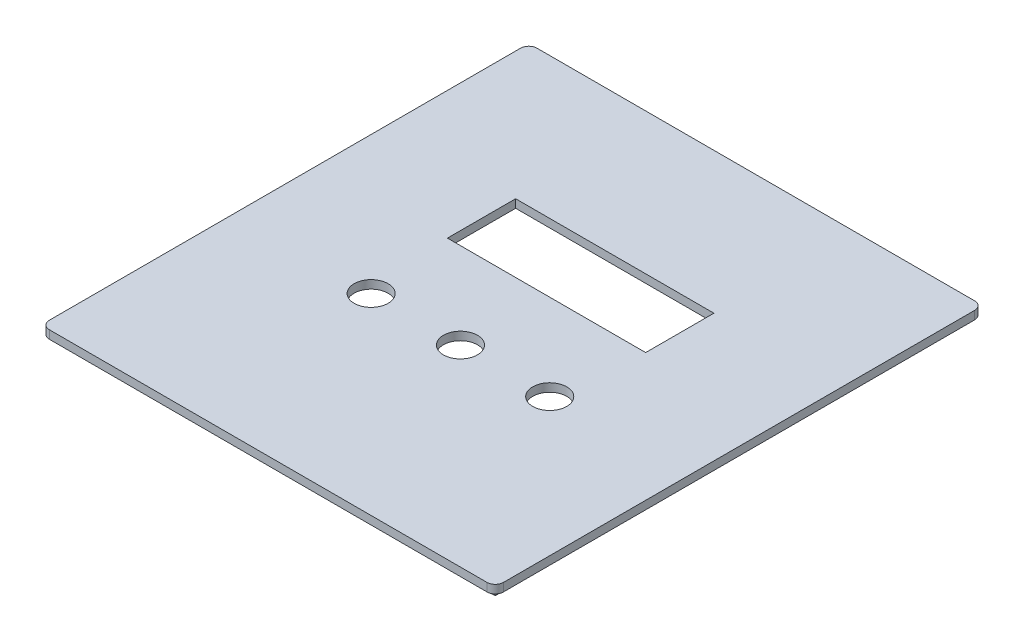
ISO-10303-21;
HEADER;
FILE_DESCRIPTION(('STEP AP214'),'2;1');
FILE_NAME('part.step','',(''),(''),'','','');
FILE_SCHEMA(('AUTOMOTIVE_DESIGN { 1 0 10303 214 1 1 1 1 }'));
ENDSEC;
DATA;
#1=APPLICATION_CONTEXT('core data for automotive mechanical design processes');
#2=APPLICATION_PROTOCOL_DEFINITION('international standard','automotive_design',2000,#1);
#3=PRODUCT_CONTEXT('',#1,'mechanical');
#4=PRODUCT('Part','Part','',(#3));
#5=PRODUCT_RELATED_PRODUCT_CATEGORY('part','',(#4));
#6=PRODUCT_DEFINITION_FORMATION('','',#4);
#7=PRODUCT_DEFINITION_CONTEXT('part definition',#1,'design');
#8=PRODUCT_DEFINITION('design','',#6,#7);
#9=PRODUCT_DEFINITION_SHAPE('','',#8);
#10=(LENGTH_UNIT() NAMED_UNIT(*) SI_UNIT(.MILLI.,.METRE.));
#11=(NAMED_UNIT(*) PLANE_ANGLE_UNIT() SI_UNIT($,.RADIAN.));
#12=(NAMED_UNIT(*) SI_UNIT($,.STERADIAN.) SOLID_ANGLE_UNIT());
#13=UNCERTAINTY_MEASURE_WITH_UNIT(LENGTH_MEASURE(1.E-05),#10,'distance_accuracy_value','');
#14=(GEOMETRIC_REPRESENTATION_CONTEXT(3) GLOBAL_UNCERTAINTY_ASSIGNED_CONTEXT((#13)) GLOBAL_UNIT_ASSIGNED_CONTEXT((#10,
#11,#12)) REPRESENTATION_CONTEXT('',''));
#15=CARTESIAN_POINT('',(0.,0.,0.));
#16=DIRECTION('',(0.,0.,1.));
#17=DIRECTION('',(1.,0.,0.));
#18=AXIS2_PLACEMENT_3D('',#15,#16,#17);
#19=CARTESIAN_POINT('',(0.,0.,0.));
#20=DIRECTION('',(0.,-1.,0.));
#21=DIRECTION('',(0.,0.,-1.));
#22=AXIS2_PLACEMENT_3D('',#19,#20,#21);
#23=PLANE('',#22);
#24=DIRECTION('',(-1.,0.,0.));
#25=VECTOR('',#24,1.);
#26=CARTESIAN_POINT('',(-78.85,0.,-84.92));
#27=LINE('',#26,#25);
#28=CARTESIAN_POINT('',(78.85,0.,-84.92));
#29=VERTEX_POINT('',#28);
#30=CARTESIAN_POINT('',(-78.85,0.,-84.92));
#31=VERTEX_POINT('',#30);
#32=EDGE_CURVE('E280',#29,#31,#27,.T.);
#33=ORIENTED_EDGE('',*,*,#32,.F.);
#34=DIRECTION('',(0.,0.,-1.));
#35=VECTOR('',#34,1.);
#36=CARTESIAN_POINT('',(78.85,0.,-84.92));
#37=LINE('',#36,#35);
#38=CARTESIAN_POINT('',(78.85,0.,84.92));
#39=VERTEX_POINT('',#38);
#40=EDGE_CURVE('E285',#39,#29,#37,.T.);
#41=ORIENTED_EDGE('',*,*,#40,.F.);
#42=DIRECTION('',(1.,0.,0.));
#43=VECTOR('',#42,1.);
#44=CARTESIAN_POINT('',(-78.85,0.,84.92));
#45=LINE('',#44,#43);
#46=CARTESIAN_POINT('',(-78.85,0.,84.92));
#47=VERTEX_POINT('',#46);
#48=EDGE_CURVE('E299',#47,#39,#45,.T.);
#49=ORIENTED_EDGE('',*,*,#48,.F.);
#50=DIRECTION('',(0.,0.,1.));
#51=VECTOR('',#50,1.);
#52=CARTESIAN_POINT('',(-78.85,0.,-84.92));
#53=LINE('',#52,#51);
#54=EDGE_CURVE('E297',#31,#47,#53,.T.);
#55=ORIENTED_EDGE('',*,*,#54,.F.);
#56=EDGE_LOOP('',(#33,#41,#49,#55));
#57=FACE_BOUND('',#56,.T.);
#58=DIRECTION('',(0.,0.,-1.));
#59=VECTOR('',#58,1.);
#60=CARTESIAN_POINT('',(75.85,0.,-81.92));
#61=LINE('',#60,#59);
#62=CARTESIAN_POINT('',(75.85,0.,81.92));
#63=VERTEX_POINT('',#62);
#64=CARTESIAN_POINT('',(75.85,0.,-81.92));
#65=VERTEX_POINT('',#64);
#66=EDGE_CURVE('E251',#63,#65,#61,.T.);
#67=ORIENTED_EDGE('',*,*,#66,.T.);
#68=DIRECTION('',(-1.,0.,0.));
#69=VECTOR('',#68,1.);
#70=CARTESIAN_POINT('',(-75.85,0.,-81.92));
#71=LINE('',#70,#69);
#72=CARTESIAN_POINT('',(-75.85,0.,-81.92));
#73=VERTEX_POINT('',#72);
#74=EDGE_CURVE('E237',#65,#73,#71,.T.);
#75=ORIENTED_EDGE('',*,*,#74,.T.);
#76=DIRECTION('',(0.,0.,1.));
#77=VECTOR('',#76,1.);
#78=CARTESIAN_POINT('',(-75.85,0.,-81.92));
#79=LINE('',#78,#77);
#80=CARTESIAN_POINT('',(-75.85,0.,81.92));
#81=VERTEX_POINT('',#80);
#82=EDGE_CURVE('E263',#73,#81,#79,.T.);
#83=ORIENTED_EDGE('',*,*,#82,.T.);
#84=DIRECTION('',(1.,0.,0.));
#85=VECTOR('',#84,1.);
#86=CARTESIAN_POINT('',(-75.85,0.,81.92));
#87=LINE('',#86,#85);
#88=EDGE_CURVE('E266',#81,#63,#87,.T.);
#89=ORIENTED_EDGE('',*,*,#88,.T.);
#90=EDGE_LOOP('',(#67,#75,#83,#89));
#91=FACE_BOUND('',#90,.T.);
#92=ADVANCED_FACE('F32',(#57,#91),#23,.T.);
#93=CARTESIAN_POINT('',(-78.85,3.,-84.92));
#94=DIRECTION('',(0.,0.,1.));
#95=DIRECTION('',(1.,0.,0.));
#96=AXIS2_PLACEMENT_3D('',#93,#94,#95);
#97=PLANE('',#96);
#98=ORIENTED_EDGE('',*,*,#32,.T.);
#99=DIRECTION('',(0.,-1.,0.));
#100=VECTOR('',#99,1.);
#101=CARTESIAN_POINT('',(-78.85,3.,-84.92));
#102=LINE('',#101,#100);
#103=CARTESIAN_POINT('',(-78.85,3.,-84.92));
#104=VERTEX_POINT('',#103);
#105=EDGE_CURVE('E310',#104,#31,#102,.T.);
#106=ORIENTED_EDGE('',*,*,#105,.F.);
#107=DIRECTION('',(-1.,0.,0.));
#108=VECTOR('',#107,1.);
#109=CARTESIAN_POINT('',(-78.85,3.,-84.92));
#110=LINE('',#109,#108);
#111=CARTESIAN_POINT('',(78.85,3.,-84.92));
#112=VERTEX_POINT('',#111);
#113=EDGE_CURVE('E281',#112,#104,#110,.T.);
#114=ORIENTED_EDGE('',*,*,#113,.F.);
#115=DIRECTION('',(0.,-1.,0.));
#116=VECTOR('',#115,1.);
#117=CARTESIAN_POINT('',(78.85,3.,-84.92));
#118=LINE('',#117,#116);
#119=EDGE_CURVE('E294',#112,#29,#118,.T.);
#120=ORIENTED_EDGE('',*,*,#119,.T.);
#121=EDGE_LOOP('',(#98,#106,#114,#120));
#122=FACE_BOUND('',#121,.T.);
#123=ADVANCED_FACE('F382',(#122),#97,.F.);
#124=CARTESIAN_POINT('',(-78.85,3.,-84.92));
#125=DIRECTION('',(1.,0.,0.));
#126=DIRECTION('',(0.,0.,-1.));
#127=AXIS2_PLACEMENT_3D('',#124,#125,#126);
#128=PLANE('',#127);
#129=ORIENTED_EDGE('',*,*,#54,.T.);
#130=DIRECTION('',(0.,-1.,0.));
#131=VECTOR('',#130,1.);
#132=CARTESIAN_POINT('',(-78.85,3.,84.92));
#133=LINE('',#132,#131);
#134=CARTESIAN_POINT('',(-78.85,3.,84.92));
#135=VERTEX_POINT('',#134);
#136=EDGE_CURVE('E307',#135,#47,#133,.T.);
#137=ORIENTED_EDGE('',*,*,#136,.F.);
#138=DIRECTION('',(0.,0.,1.));
#139=VECTOR('',#138,1.);
#140=CARTESIAN_POINT('',(-78.85,3.,-84.92));
#141=LINE('',#140,#139);
#142=EDGE_CURVE('E284',#104,#135,#141,.T.);
#143=ORIENTED_EDGE('',*,*,#142,.F.);
#144=ORIENTED_EDGE('',*,*,#105,.T.);
#145=EDGE_LOOP('',(#129,#137,#143,#144));
#146=FACE_BOUND('',#145,.T.);
#147=ADVANCED_FACE('F388',(#146),#128,.F.);
#148=CARTESIAN_POINT('',(-78.85,3.,84.92));
#149=DIRECTION('',(0.,0.,-1.));
#150=DIRECTION('',(-1.,0.,0.));
#151=AXIS2_PLACEMENT_3D('',#148,#149,#150);
#152=PLANE('',#151);
#153=ORIENTED_EDGE('',*,*,#48,.T.);
#154=DIRECTION('',(0.,-1.,0.));
#155=VECTOR('',#154,1.);
#156=CARTESIAN_POINT('',(78.85,3.,84.92));
#157=LINE('',#156,#155);
#158=CARTESIAN_POINT('',(78.85,3.,84.92));
#159=VERTEX_POINT('',#158);
#160=EDGE_CURVE('E304',#159,#39,#157,.T.);
#161=ORIENTED_EDGE('',*,*,#160,.F.);
#162=DIRECTION('',(1.,0.,0.));
#163=VECTOR('',#162,1.);
#164=CARTESIAN_POINT('',(-78.85,3.,84.92));
#165=LINE('',#164,#163);
#166=EDGE_CURVE('E288',#135,#159,#165,.T.);
#167=ORIENTED_EDGE('',*,*,#166,.F.);
#168=ORIENTED_EDGE('',*,*,#136,.T.);
#169=EDGE_LOOP('',(#153,#161,#167,#168));
#170=FACE_BOUND('',#169,.T.);
#171=ADVANCED_FACE('F400',(#170),#152,.F.);
#172=CARTESIAN_POINT('',(78.85,3.,-84.92));
#173=DIRECTION('',(-1.,0.,0.));
#174=DIRECTION('',(0.,0.,1.));
#175=AXIS2_PLACEMENT_3D('',#172,#173,#174);
#176=PLANE('',#175);
#177=ORIENTED_EDGE('',*,*,#40,.T.);
#178=ORIENTED_EDGE('',*,*,#119,.F.);
#179=DIRECTION('',(0.,0.,-1.));
#180=VECTOR('',#179,1.);
#181=CARTESIAN_POINT('',(78.85,3.,-84.92));
#182=LINE('',#181,#180);
#183=EDGE_CURVE('E291',#159,#112,#182,.T.);
#184=ORIENTED_EDGE('',*,*,#183,.F.);
#185=ORIENTED_EDGE('',*,*,#160,.T.);
#186=EDGE_LOOP('',(#177,#178,#184,#185));
#187=FACE_BOUND('',#186,.T.);
#188=ADVANCED_FACE('F397',(#187),#176,.F.);
#189=CARTESIAN_POINT('',(-75.85,3.,-81.92));
#190=DIRECTION('',(0.,0.,1.));
#191=DIRECTION('',(1.,0.,0.));
#192=AXIS2_PLACEMENT_3D('',#189,#190,#191);
#193=PLANE('',#192);
#194=ORIENTED_EDGE('',*,*,#74,.F.);
#195=DIRECTION('',(0.,-1.,0.));
#196=VECTOR('',#195,1.);
#197=CARTESIAN_POINT('',(75.85,3.,-81.92));
#198=LINE('',#197,#196);
#199=CARTESIAN_POINT('',(75.85,3.,-81.92));
#200=VERTEX_POINT('',#199);
#201=EDGE_CURVE('E260',#200,#65,#198,.T.);
#202=ORIENTED_EDGE('',*,*,#201,.F.);
#203=DIRECTION('',(-1.,0.,0.));
#204=VECTOR('',#203,1.);
#205=CARTESIAN_POINT('',(-75.85,3.,-81.92));
#206=LINE('',#205,#204);
#207=CARTESIAN_POINT('',(-75.85,3.,-81.92));
#208=VERTEX_POINT('',#207);
#209=EDGE_CURVE('E247',#200,#208,#206,.T.);
#210=ORIENTED_EDGE('',*,*,#209,.T.);
#211=DIRECTION('',(0.,-1.,0.));
#212=VECTOR('',#211,1.);
#213=CARTESIAN_POINT('',(-75.85,3.,-81.92));
#214=LINE('',#213,#212);
#215=EDGE_CURVE('E277',#208,#73,#214,.T.);
#216=ORIENTED_EDGE('',*,*,#215,.T.);
#217=EDGE_LOOP('',(#194,#202,#210,#216));
#218=FACE_BOUND('',#217,.T.);
#219=ADVANCED_FACE('F395',(#218),#193,.T.);
#220=CARTESIAN_POINT('',(-75.85,3.,-81.92));
#221=DIRECTION('',(1.,0.,0.));
#222=DIRECTION('',(0.,0.,-1.));
#223=AXIS2_PLACEMENT_3D('',#220,#221,#222);
#224=PLANE('',#223);
#225=ORIENTED_EDGE('',*,*,#82,.F.);
#226=ORIENTED_EDGE('',*,*,#215,.F.);
#227=DIRECTION('',(0.,0.,1.));
#228=VECTOR('',#227,1.);
#229=CARTESIAN_POINT('',(-75.85,3.,-81.92));
#230=LINE('',#229,#228);
#231=CARTESIAN_POINT('',(-75.85,3.,81.92));
#232=VERTEX_POINT('',#231);
#233=EDGE_CURVE('E250',#208,#232,#230,.T.);
#234=ORIENTED_EDGE('',*,*,#233,.T.);
#235=DIRECTION('',(0.,-1.,0.));
#236=VECTOR('',#235,1.);
#237=CARTESIAN_POINT('',(-75.85,3.,81.92));
#238=LINE('',#237,#236);
#239=EDGE_CURVE('E275',#232,#81,#238,.T.);
#240=ORIENTED_EDGE('',*,*,#239,.T.);
#241=EDGE_LOOP('',(#225,#226,#234,#240));
#242=FACE_BOUND('',#241,.T.);
#243=ADVANCED_FACE('F558',(#242),#224,.T.);
#244=CARTESIAN_POINT('',(-75.85,3.,81.92));
#245=DIRECTION('',(0.,0.,-1.));
#246=DIRECTION('',(-1.,0.,0.));
#247=AXIS2_PLACEMENT_3D('',#244,#245,#246);
#248=PLANE('',#247);
#249=ORIENTED_EDGE('',*,*,#88,.F.);
#250=ORIENTED_EDGE('',*,*,#239,.F.);
#251=DIRECTION('',(1.,0.,0.));
#252=VECTOR('',#251,1.);
#253=CARTESIAN_POINT('',(-75.85,3.,81.92));
#254=LINE('',#253,#252);
#255=CARTESIAN_POINT('',(75.85,3.,81.92));
#256=VERTEX_POINT('',#255);
#257=EDGE_CURVE('E254',#232,#256,#254,.T.);
#258=ORIENTED_EDGE('',*,*,#257,.T.);
#259=DIRECTION('',(0.,-1.,0.));
#260=VECTOR('',#259,1.);
#261=CARTESIAN_POINT('',(75.85,3.,81.92));
#262=LINE('',#261,#260);
#263=EDGE_CURVE('E273',#256,#63,#262,.T.);
#264=ORIENTED_EDGE('',*,*,#263,.T.);
#265=EDGE_LOOP('',(#249,#250,#258,#264));
#266=FACE_BOUND('',#265,.T.);
#267=ADVANCED_FACE('F549',(#266),#248,.T.);
#268=CARTESIAN_POINT('',(75.85,3.,-81.92));
#269=DIRECTION('',(-1.,0.,0.));
#270=DIRECTION('',(0.,0.,1.));
#271=AXIS2_PLACEMENT_3D('',#268,#269,#270);
#272=PLANE('',#271);
#273=ORIENTED_EDGE('',*,*,#66,.F.);
#274=ORIENTED_EDGE('',*,*,#263,.F.);
#275=DIRECTION('',(0.,0.,-1.));
#276=VECTOR('',#275,1.);
#277=CARTESIAN_POINT('',(75.85,3.,-81.92));
#278=LINE('',#277,#276);
#279=EDGE_CURVE('E257',#256,#200,#278,.T.);
#280=ORIENTED_EDGE('',*,*,#279,.T.);
#281=ORIENTED_EDGE('',*,*,#201,.T.);
#282=EDGE_LOOP('',(#273,#274,#280,#281));
#283=FACE_BOUND('',#282,.T.);
#284=ADVANCED_FACE('F541',(#283),#272,.T.);
#285=CARTESIAN_POINT('',(0.,3.,0.));
#286=DIRECTION('',(0.,1.,0.));
#287=DIRECTION('',(0.,0.,1.));
#288=AXIS2_PLACEMENT_3D('',#285,#286,#287);
#289=PLANE('',#288);
#290=DIRECTION('',(0.,0.,1.));
#291=VECTOR('',#290,1.);
#292=CARTESIAN_POINT('',(35.865,3.,-37.18));
#293=LINE('',#292,#291);
#294=CARTESIAN_POINT('',(35.865,3.,-37.18));
#295=VERTEX_POINT('',#294);
#296=CARTESIAN_POINT('',(35.865,3.,-12.5));
#297=VERTEX_POINT('',#296);
#298=EDGE_CURVE('E618',#295,#297,#293,.T.);
#299=ORIENTED_EDGE('',*,*,#298,.F.);
#300=DIRECTION('',(1.,0.,0.));
#301=VECTOR('',#300,1.);
#302=CARTESIAN_POINT('',(-35.865,3.,-37.18));
#303=LINE('',#302,#301);
#304=CARTESIAN_POINT('',(-35.865,3.,-37.18));
#305=VERTEX_POINT('',#304);
#306=EDGE_CURVE('E207',#305,#295,#303,.T.);
#307=ORIENTED_EDGE('',*,*,#306,.F.);
#308=DIRECTION('',(0.,0.,-1.));
#309=VECTOR('',#308,1.);
#310=CARTESIAN_POINT('',(-35.865,3.,-37.18));
#311=LINE('',#310,#309);
#312=CARTESIAN_POINT('',(-35.865,3.,-12.5));
#313=VERTEX_POINT('',#312);
#314=EDGE_CURVE('E204',#313,#305,#311,.T.);
#315=ORIENTED_EDGE('',*,*,#314,.F.);
#316=DIRECTION('',(-1.,0.,0.));
#317=VECTOR('',#316,1.);
#318=CARTESIAN_POINT('',(-35.865,3.,-12.5));
#319=LINE('',#318,#317);
#320=EDGE_CURVE('E177',#297,#313,#319,.T.);
#321=ORIENTED_EDGE('',*,*,#320,.F.);
#322=EDGE_LOOP('',(#299,#307,#315,#321));
#323=FACE_BOUND('',#322,.T.);
#324=CARTESIAN_POINT('',(0.,3.,18.655));
#325=DIRECTION('',(0.,1.,0.));
#326=DIRECTION('',(0.,0.,1.));
#327=AXIS2_PLACEMENT_3D('',#324,#325,#326);
#328=CIRCLE('',#327,6.155);
#329=CARTESIAN_POINT('',(0.,3.,24.81));
#330=VERTEX_POINT('',#329);
#331=EDGE_CURVE('E211',#330,#330,#328,.F.);
#332=ORIENTED_EDGE('',*,*,#331,.F.);
#333=EDGE_LOOP('',(#332));
#334=FACE_BOUND('',#333,.T.);
#335=CARTESIAN_POINT('',(32.31,3.,18.655));
#336=DIRECTION('',(0.,1.,0.));
#337=DIRECTION('',(0.,0.,1.));
#338=AXIS2_PLACEMENT_3D('',#335,#336,#337);
#339=CIRCLE('',#338,6.155);
#340=CARTESIAN_POINT('',(32.31,3.,24.81));
#341=VERTEX_POINT('',#340);
#342=EDGE_CURVE('E212',#341,#341,#339,.F.);
#343=ORIENTED_EDGE('',*,*,#342,.F.);
#344=EDGE_LOOP('',(#343));
#345=FACE_BOUND('',#344,.T.);
#346=CARTESIAN_POINT('',(-32.31,3.,18.655));
#347=DIRECTION('',(0.,1.,0.));
#348=DIRECTION('',(0.,0.,1.));
#349=AXIS2_PLACEMENT_3D('',#346,#347,#348);
#350=CIRCLE('',#349,6.155);
#351=CARTESIAN_POINT('',(-32.31,3.,24.81));
#352=VERTEX_POINT('',#351);
#353=EDGE_CURVE('E218',#352,#352,#350,.F.);
#354=ORIENTED_EDGE('',*,*,#353,.F.);
#355=EDGE_LOOP('',(#354));
#356=FACE_BOUND('',#355,.T.);
#357=ORIENTED_EDGE('',*,*,#209,.F.);
#358=ORIENTED_EDGE('',*,*,#279,.F.);
#359=ORIENTED_EDGE('',*,*,#257,.F.);
#360=ORIENTED_EDGE('',*,*,#233,.F.);
#361=EDGE_LOOP('',(#357,#358,#359,#360));
#362=FACE_BOUND('',#361,.T.);
#363=ADVANCED_FACE('F534',(#323,#334,#345,#356,#362),#289,.F.);
#364=DIRECTION('',(0.,0.,1.));
#365=VECTOR('',#364,1.);
#366=CARTESIAN_POINT('',(-82.15,3.,-88.22));
#367=LINE('',#366,#365);
#368=CARTESIAN_POINT('',(-82.15,3.,-85.22));
#369=VERTEX_POINT('',#368);
#370=CARTESIAN_POINT('',(-82.15,3.,85.22));
#371=VERTEX_POINT('',#370);
#372=EDGE_CURVE('E243',#369,#371,#367,.T.);
#373=ORIENTED_EDGE('',*,*,#372,.F.);
#374=CARTESIAN_POINT('',(-79.15,3.,-85.22));
#375=DIRECTION('',(0.,1.,0.));
#376=DIRECTION('',(0.,0.,1.));
#377=AXIS2_PLACEMENT_3D('',#374,#375,#376);
#378=CIRCLE('',#377,3.);
#379=CARTESIAN_POINT('',(-79.15,3.,-88.22));
#380=VERTEX_POINT('',#379);
#381=EDGE_CURVE('E324',#369,#380,#378,.F.);
#382=ORIENTED_EDGE('',*,*,#381,.T.);
#383=DIRECTION('',(-1.,0.,0.));
#384=VECTOR('',#383,1.);
#385=CARTESIAN_POINT('',(82.15,3.,-88.22));
#386=LINE('',#385,#384);
#387=CARTESIAN_POINT('',(79.15,3.,-88.22));
#388=VERTEX_POINT('',#387);
#389=EDGE_CURVE('E240',#388,#380,#386,.T.);
#390=ORIENTED_EDGE('',*,*,#389,.F.);
#391=CARTESIAN_POINT('',(79.15,3.,-85.22));
#392=DIRECTION('',(0.,1.,0.));
#393=DIRECTION('',(0.,0.,1.));
#394=AXIS2_PLACEMENT_3D('',#391,#392,#393);
#395=CIRCLE('',#394,3.);
#396=CARTESIAN_POINT('',(82.15,3.,-85.22));
#397=VERTEX_POINT('',#396);
#398=EDGE_CURVE('E322',#388,#397,#395,.F.);
#399=ORIENTED_EDGE('',*,*,#398,.T.);
#400=DIRECTION('',(0.,0.,-1.));
#401=VECTOR('',#400,1.);
#402=CARTESIAN_POINT('',(82.15,3.,88.22));
#403=LINE('',#402,#401);
#404=CARTESIAN_POINT('',(82.15,3.,85.22));
#405=VERTEX_POINT('',#404);
#406=EDGE_CURVE('E206',#405,#397,#403,.T.);
#407=ORIENTED_EDGE('',*,*,#406,.F.);
#408=CARTESIAN_POINT('',(79.15,3.,85.22));
#409=DIRECTION('',(0.,1.,0.));
#410=DIRECTION('',(0.,0.,1.));
#411=AXIS2_PLACEMENT_3D('',#408,#409,#410);
#412=CIRCLE('',#411,3.);
#413=CARTESIAN_POINT('',(79.15,3.,88.22));
#414=VERTEX_POINT('',#413);
#415=EDGE_CURVE('E320',#405,#414,#412,.F.);
#416=ORIENTED_EDGE('',*,*,#415,.T.);
#417=DIRECTION('',(1.,0.,0.));
#418=VECTOR('',#417,1.);
#419=CARTESIAN_POINT('',(-82.15,3.,88.22));
#420=LINE('',#419,#418);
#421=CARTESIAN_POINT('',(-79.15,3.,88.22));
#422=VERTEX_POINT('',#421);
#423=EDGE_CURVE('E230',#422,#414,#420,.T.);
#424=ORIENTED_EDGE('',*,*,#423,.F.);
#425=CARTESIAN_POINT('',(-79.15,3.,85.22));
#426=DIRECTION('',(0.,1.,0.));
#427=DIRECTION('',(0.,0.,1.));
#428=AXIS2_PLACEMENT_3D('',#425,#426,#427);
#429=CIRCLE('',#428,3.);
#430=EDGE_CURVE('E318',#422,#371,#429,.F.);
#431=ORIENTED_EDGE('',*,*,#430,.T.);
#432=EDGE_LOOP('',(#373,#382,#390,#399,#407,#416,#424,#431));
#433=FACE_BOUND('',#432,.T.);
#434=ORIENTED_EDGE('',*,*,#183,.T.);
#435=ORIENTED_EDGE('',*,*,#113,.T.);
#436=ORIENTED_EDGE('',*,*,#142,.T.);
#437=ORIENTED_EDGE('',*,*,#166,.T.);
#438=EDGE_LOOP('',(#434,#435,#436,#437));
#439=FACE_BOUND('',#438,.T.);
#440=ADVANCED_FACE('F349',(#433,#439),#289,.F.);
#441=CARTESIAN_POINT('',(82.15,6.,88.22));
#442=DIRECTION('',(-1.,0.,0.));
#443=DIRECTION('',(0.,0.,1.));
#444=AXIS2_PLACEMENT_3D('',#441,#442,#443);
#445=PLANE('',#444);
#446=ORIENTED_EDGE('',*,*,#406,.T.);
#447=DIRECTION('',(0.,-1.,0.));
#448=VECTOR('',#447,1.);
#449=CARTESIAN_POINT('',(82.15,6.,-85.22));
#450=LINE('',#449,#448);
#451=CARTESIAN_POINT('',(82.15,6.,-85.22));
#452=VERTEX_POINT('',#451);
#453=EDGE_CURVE('E341',#397,#452,#450,.F.);
#454=ORIENTED_EDGE('',*,*,#453,.T.);
#455=DIRECTION('',(0.,0.,-1.));
#456=VECTOR('',#455,1.);
#457=CARTESIAN_POINT('',(82.15,6.,88.22));
#458=LINE('',#457,#456);
#459=CARTESIAN_POINT('',(82.15,6.,85.22));
#460=VERTEX_POINT('',#459);
#461=EDGE_CURVE('E226',#460,#452,#458,.T.);
#462=ORIENTED_EDGE('',*,*,#461,.F.);
#463=DIRECTION('',(0.,-1.,0.));
#464=VECTOR('',#463,1.);
#465=CARTESIAN_POINT('',(82.15,6.,85.22));
#466=LINE('',#465,#464);
#467=EDGE_CURVE('E338',#460,#405,#466,.T.);
#468=ORIENTED_EDGE('',*,*,#467,.T.);
#469=EDGE_LOOP('',(#446,#454,#462,#468));
#470=FACE_BOUND('',#469,.T.);
#471=ADVANCED_FACE('F358',(#470),#445,.F.);
#472=CARTESIAN_POINT('',(82.15,6.,-88.22));
#473=DIRECTION('',(0.,0.,1.));
#474=DIRECTION('',(1.,0.,0.));
#475=AXIS2_PLACEMENT_3D('',#472,#473,#474);
#476=PLANE('',#475);
#477=ORIENTED_EDGE('',*,*,#389,.T.);
#478=DIRECTION('',(0.,-1.,0.));
#479=VECTOR('',#478,1.);
#480=CARTESIAN_POINT('',(-79.15,6.,-88.22));
#481=LINE('',#480,#479);
#482=CARTESIAN_POINT('',(-79.15,6.,-88.22));
#483=VERTEX_POINT('',#482);
#484=EDGE_CURVE('E329',#380,#483,#481,.F.);
#485=ORIENTED_EDGE('',*,*,#484,.T.);
#486=DIRECTION('',(-1.,0.,0.));
#487=VECTOR('',#486,1.);
#488=CARTESIAN_POINT('',(82.15,6.,-88.22));
#489=LINE('',#488,#487);
#490=CARTESIAN_POINT('',(79.15,6.,-88.22));
#491=VERTEX_POINT('',#490);
#492=EDGE_CURVE('E229',#491,#483,#489,.T.);
#493=ORIENTED_EDGE('',*,*,#492,.F.);
#494=DIRECTION('',(0.,-1.,0.));
#495=VECTOR('',#494,1.);
#496=CARTESIAN_POINT('',(79.15,6.,-88.22));
#497=LINE('',#496,#495);
#498=EDGE_CURVE('E326',#491,#388,#497,.T.);
#499=ORIENTED_EDGE('',*,*,#498,.T.);
#500=EDGE_LOOP('',(#477,#485,#493,#499));
#501=FACE_BOUND('',#500,.T.);
#502=ADVANCED_FACE('F367',(#501),#476,.F.);
#503=CARTESIAN_POINT('',(-82.15,6.,-88.22));
#504=DIRECTION('',(1.,0.,0.));
#505=DIRECTION('',(0.,0.,-1.));
#506=AXIS2_PLACEMENT_3D('',#503,#504,#505);
#507=PLANE('',#506);
#508=DIRECTION('',(0.,0.,1.));
#509=VECTOR('',#508,1.);
#510=CARTESIAN_POINT('',(-82.15,6.,-88.22));
#511=LINE('',#510,#509);
#512=CARTESIAN_POINT('',(-82.15,6.,-85.22));
#513=VERTEX_POINT('',#512);
#514=CARTESIAN_POINT('',(-82.15,6.,85.22));
#515=VERTEX_POINT('',#514);
#516=EDGE_CURVE('E233',#513,#515,#511,.T.);
#517=ORIENTED_EDGE('',*,*,#516,.F.);
#518=DIRECTION('',(0.,-1.,0.));
#519=VECTOR('',#518,1.);
#520=CARTESIAN_POINT('',(-82.15,6.,-85.22));
#521=LINE('',#520,#519);
#522=EDGE_CURVE('E315',#513,#369,#521,.T.);
#523=ORIENTED_EDGE('',*,*,#522,.T.);
#524=ORIENTED_EDGE('',*,*,#372,.T.);
#525=DIRECTION('',(0.,-1.,0.));
#526=VECTOR('',#525,1.);
#527=CARTESIAN_POINT('',(-82.15,6.,85.22));
#528=LINE('',#527,#526);
#529=EDGE_CURVE('E313',#371,#515,#528,.F.);
#530=ORIENTED_EDGE('',*,*,#529,.T.);
#531=EDGE_LOOP('',(#517,#523,#524,#530));
#532=FACE_BOUND('',#531,.T.);
#533=ADVANCED_FACE('F375',(#532),#507,.F.);
#534=CARTESIAN_POINT('',(-82.15,6.,88.22));
#535=DIRECTION('',(0.,0.,-1.));
#536=DIRECTION('',(-1.,0.,0.));
#537=AXIS2_PLACEMENT_3D('',#534,#535,#536);
#538=PLANE('',#537);
#539=ORIENTED_EDGE('',*,*,#423,.T.);
#540=DIRECTION('',(0.,-1.,0.));
#541=VECTOR('',#540,1.);
#542=CARTESIAN_POINT('',(79.15,6.,88.22));
#543=LINE('',#542,#541);
#544=CARTESIAN_POINT('',(79.15,6.,88.22));
#545=VERTEX_POINT('',#544);
#546=EDGE_CURVE('E11',#414,#545,#543,.F.);
#547=ORIENTED_EDGE('',*,*,#546,.T.);
#548=DIRECTION('',(1.,0.,0.));
#549=VECTOR('',#548,1.);
#550=CARTESIAN_POINT('',(-82.15,6.,88.22));
#551=LINE('',#550,#549);
#552=CARTESIAN_POINT('',(-79.15,6.,88.22));
#553=VERTEX_POINT('',#552);
#554=EDGE_CURVE('E235',#553,#545,#551,.T.);
#555=ORIENTED_EDGE('',*,*,#554,.F.);
#556=DIRECTION('',(0.,-1.,0.));
#557=VECTOR('',#556,1.);
#558=CARTESIAN_POINT('',(-79.15,6.,88.22));
#559=LINE('',#558,#557);
#560=EDGE_CURVE('E40',#553,#422,#559,.T.);
#561=ORIENTED_EDGE('',*,*,#560,.T.);
#562=EDGE_LOOP('',(#539,#547,#555,#561));
#563=FACE_BOUND('',#562,.T.);
#564=ADVANCED_FACE('F345',(#563),#538,.F.);
#565=CARTESIAN_POINT('',(0.,6.,0.));
#566=DIRECTION('',(0.,1.,0.));
#567=DIRECTION('',(0.,0.,1.));
#568=AXIS2_PLACEMENT_3D('',#565,#566,#567);
#569=PLANE('',#568);
#570=DIRECTION('',(-1.,0.,0.));
#571=VECTOR('',#570,1.);
#572=CARTESIAN_POINT('',(-35.865,6.,-37.18));
#573=LINE('',#572,#571);
#574=CARTESIAN_POINT('',(35.865,6.,-37.18));
#575=VERTEX_POINT('',#574);
#576=CARTESIAN_POINT('',(-35.865,6.,-37.18));
#577=VERTEX_POINT('',#576);
#578=EDGE_CURVE('E190',#575,#577,#573,.T.);
#579=ORIENTED_EDGE('',*,*,#578,.F.);
#580=DIRECTION('',(0.,0.,-1.));
#581=VECTOR('',#580,1.);
#582=CARTESIAN_POINT('',(35.865,6.,-37.18));
#583=LINE('',#582,#581);
#584=CARTESIAN_POINT('',(35.865,6.,-12.5));
#585=VERTEX_POINT('',#584);
#586=EDGE_CURVE('E195',#585,#575,#583,.T.);
#587=ORIENTED_EDGE('',*,*,#586,.F.);
#588=DIRECTION('',(1.,0.,0.));
#589=VECTOR('',#588,1.);
#590=CARTESIAN_POINT('',(-35.865,6.,-12.5));
#591=LINE('',#590,#589);
#592=CARTESIAN_POINT('',(-35.865,6.,-12.5));
#593=VERTEX_POINT('',#592);
#594=EDGE_CURVE('E174',#593,#585,#591,.T.);
#595=ORIENTED_EDGE('',*,*,#594,.F.);
#596=DIRECTION('',(0.,0.,1.));
#597=VECTOR('',#596,1.);
#598=CARTESIAN_POINT('',(-35.865,6.,-37.18));
#599=LINE('',#598,#597);
#600=EDGE_CURVE('E185',#577,#593,#599,.T.);
#601=ORIENTED_EDGE('',*,*,#600,.F.);
#602=EDGE_LOOP('',(#579,#587,#595,#601));
#603=FACE_BOUND('',#602,.T.);
#604=CARTESIAN_POINT('',(0.,6.,18.655));
#605=DIRECTION('',(0.,1.,0.));
#606=DIRECTION('',(0.,0.,1.));
#607=AXIS2_PLACEMENT_3D('',#604,#605,#606);
#608=CIRCLE('',#607,6.155);
#609=CARTESIAN_POINT('',(0.,6.,24.81));
#610=VERTEX_POINT('',#609);
#611=EDGE_CURVE('E208',#610,#610,#608,.T.);
#612=ORIENTED_EDGE('',*,*,#611,.F.);
#613=EDGE_LOOP('',(#612));
#614=FACE_BOUND('',#613,.T.);
#615=CARTESIAN_POINT('',(32.31,6.,18.655));
#616=DIRECTION('',(0.,1.,0.));
#617=DIRECTION('',(0.,0.,1.));
#618=AXIS2_PLACEMENT_3D('',#615,#616,#617);
#619=CIRCLE('',#618,6.155);
#620=CARTESIAN_POINT('',(32.31,6.,24.81));
#621=VERTEX_POINT('',#620);
#622=EDGE_CURVE('E215',#621,#621,#619,.T.);
#623=ORIENTED_EDGE('',*,*,#622,.F.);
#624=EDGE_LOOP('',(#623));
#625=FACE_BOUND('',#624,.T.);
#626=CARTESIAN_POINT('',(-32.31,6.,18.655));
#627=DIRECTION('',(0.,1.,0.));
#628=DIRECTION('',(0.,0.,1.));
#629=AXIS2_PLACEMENT_3D('',#626,#627,#628);
#630=CIRCLE('',#629,6.155);
#631=CARTESIAN_POINT('',(-32.31,6.,24.81));
#632=VERTEX_POINT('',#631);
#633=EDGE_CURVE('E221',#632,#632,#630,.T.);
#634=ORIENTED_EDGE('',*,*,#633,.F.);
#635=EDGE_LOOP('',(#634));
#636=FACE_BOUND('',#635,.T.);
#637=ORIENTED_EDGE('',*,*,#492,.T.);
#638=CARTESIAN_POINT('',(-79.15,6.,-85.22));
#639=DIRECTION('',(0.,1.,0.));
#640=DIRECTION('',(0.,0.,1.));
#641=AXIS2_PLACEMENT_3D('',#638,#639,#640);
#642=CIRCLE('',#641,3.);
#643=EDGE_CURVE('E336',#483,#513,#642,.T.);
#644=ORIENTED_EDGE('',*,*,#643,.T.);
#645=ORIENTED_EDGE('',*,*,#516,.T.);
#646=CARTESIAN_POINT('',(-79.15,6.,85.22));
#647=DIRECTION('',(0.,1.,0.));
#648=DIRECTION('',(0.,0.,1.));
#649=AXIS2_PLACEMENT_3D('',#646,#647,#648);
#650=CIRCLE('',#649,3.);
#651=EDGE_CURVE('E52',#515,#553,#650,.T.);
#652=ORIENTED_EDGE('',*,*,#651,.T.);
#653=ORIENTED_EDGE('',*,*,#554,.T.);
#654=CARTESIAN_POINT('',(79.15,6.,85.22));
#655=DIRECTION('',(0.,1.,0.));
#656=DIRECTION('',(0.,0.,1.));
#657=AXIS2_PLACEMENT_3D('',#654,#655,#656);
#658=CIRCLE('',#657,3.);
#659=EDGE_CURVE('E332',#545,#460,#658,.T.);
#660=ORIENTED_EDGE('',*,*,#659,.T.);
#661=ORIENTED_EDGE('',*,*,#461,.T.);
#662=CARTESIAN_POINT('',(79.15,6.,-85.22));
#663=DIRECTION('',(0.,1.,0.));
#664=DIRECTION('',(0.,0.,1.));
#665=AXIS2_PLACEMENT_3D('',#662,#663,#664);
#666=CIRCLE('',#665,3.);
#667=EDGE_CURVE('E334',#452,#491,#666,.T.);
#668=ORIENTED_EDGE('',*,*,#667,.T.);
#669=EDGE_LOOP('',(#637,#644,#645,#652,#653,#660,#661,#668));
#670=FACE_BOUND('',#669,.T.);
#671=ADVANCED_FACE('F192',(#603,#614,#625,#636,#670),#569,.T.);
#672=CARTESIAN_POINT('',(-32.31,-72.8570715226999,18.655));
#673=DIRECTION('',(0.,1.,0.));
#674=DIRECTION('',(0.,0.,1.));
#675=AXIS2_PLACEMENT_3D('',#672,#673,#674);
#676=CYLINDRICAL_SURFACE('',#675,6.155);
#677=ORIENTED_EDGE('',*,*,#353,.T.);
#678=EDGE_LOOP('',(#677));
#679=FACE_BOUND('',#678,.T.);
#680=ORIENTED_EDGE('',*,*,#633,.T.);
#681=EDGE_LOOP('',(#680));
#682=FACE_BOUND('',#681,.T.);
#683=ADVANCED_FACE('F483',(#679,#682),#676,.F.);
#684=CARTESIAN_POINT('',(32.31,-72.8570715226999,18.655));
#685=DIRECTION('',(0.,1.,0.));
#686=DIRECTION('',(0.,0.,1.));
#687=AXIS2_PLACEMENT_3D('',#684,#685,#686);
#688=CYLINDRICAL_SURFACE('',#687,6.155);
#689=ORIENTED_EDGE('',*,*,#342,.T.);
#690=EDGE_LOOP('',(#689));
#691=FACE_BOUND('',#690,.T.);
#692=ORIENTED_EDGE('',*,*,#622,.T.);
#693=EDGE_LOOP('',(#692));
#694=FACE_BOUND('',#693,.T.);
#695=ADVANCED_FACE('F474',(#691,#694),#688,.F.);
#696=CARTESIAN_POINT('',(0.,-72.8570715226999,18.655));
#697=DIRECTION('',(0.,1.,0.));
#698=DIRECTION('',(0.,0.,1.));
#699=AXIS2_PLACEMENT_3D('',#696,#697,#698);
#700=CYLINDRICAL_SURFACE('',#699,6.155);
#701=ORIENTED_EDGE('',*,*,#331,.T.);
#702=EDGE_LOOP('',(#701));
#703=FACE_BOUND('',#702,.T.);
#704=ORIENTED_EDGE('',*,*,#611,.T.);
#705=EDGE_LOOP('',(#704));
#706=FACE_BOUND('',#705,.T.);
#707=ADVANCED_FACE('F465',(#703,#706),#700,.F.);
#708=CARTESIAN_POINT('',(-35.865,-72.8570715226999,-37.18));
#709=DIRECTION('',(0.,0.,-1.));
#710=DIRECTION('',(-1.,0.,0.));
#711=AXIS2_PLACEMENT_3D('',#708,#709,#710);
#712=PLANE('',#711);
#713=ORIENTED_EDGE('',*,*,#306,.T.);
#714=DIRECTION('',(0.,1.,0.));
#715=VECTOR('',#714,1.);
#716=CARTESIAN_POINT('',(35.865,-72.8570715226999,-37.18));
#717=LINE('',#716,#715);
#718=EDGE_CURVE('E200',#295,#575,#717,.T.);
#719=ORIENTED_EDGE('',*,*,#718,.T.);
#720=ORIENTED_EDGE('',*,*,#578,.T.);
#721=DIRECTION('',(0.,1.,0.));
#722=VECTOR('',#721,1.);
#723=CARTESIAN_POINT('',(-35.865,-72.8570715226999,-37.18));
#724=LINE('',#723,#722);
#725=EDGE_CURVE('E181',#305,#577,#724,.T.);
#726=ORIENTED_EDGE('',*,*,#725,.F.);
#727=EDGE_LOOP('',(#713,#719,#720,#726));
#728=FACE_BOUND('',#727,.T.);
#729=ADVANCED_FACE('F456',(#728),#712,.F.);
#730=CARTESIAN_POINT('',(35.865,-72.8570715226999,-37.18));
#731=DIRECTION('',(1.,0.,0.));
#732=DIRECTION('',(0.,0.,-1.));
#733=AXIS2_PLACEMENT_3D('',#730,#731,#732);
#734=PLANE('',#733);
#735=ORIENTED_EDGE('',*,*,#298,.T.);
#736=DIRECTION('',(0.,1.,0.));
#737=VECTOR('',#736,1.);
#738=CARTESIAN_POINT('',(35.865,-72.8570715226999,-12.5));
#739=LINE('',#738,#737);
#740=EDGE_CURVE('E180',#297,#585,#739,.T.);
#741=ORIENTED_EDGE('',*,*,#740,.T.);
#742=ORIENTED_EDGE('',*,*,#586,.T.);
#743=ORIENTED_EDGE('',*,*,#718,.F.);
#744=EDGE_LOOP('',(#735,#741,#742,#743));
#745=FACE_BOUND('',#744,.T.);
#746=ADVANCED_FACE('F448',(#745),#734,.F.);
#747=CARTESIAN_POINT('',(-35.865,-72.8570715226999,-12.5));
#748=DIRECTION('',(0.,0.,1.));
#749=DIRECTION('',(1.,0.,0.));
#750=AXIS2_PLACEMENT_3D('',#747,#748,#749);
#751=PLANE('',#750);
#752=ORIENTED_EDGE('',*,*,#320,.T.);
#753=DIRECTION('',(0.,1.,0.));
#754=VECTOR('',#753,1.);
#755=CARTESIAN_POINT('',(-35.865,-72.8570715226999,-12.5));
#756=LINE('',#755,#754);
#757=EDGE_CURVE('E169',#313,#593,#756,.T.);
#758=ORIENTED_EDGE('',*,*,#757,.T.);
#759=ORIENTED_EDGE('',*,*,#594,.T.);
#760=ORIENTED_EDGE('',*,*,#740,.F.);
#761=EDGE_LOOP('',(#752,#758,#759,#760));
#762=FACE_BOUND('',#761,.T.);
#763=ADVANCED_FACE('F171',(#762),#751,.F.);
#764=CARTESIAN_POINT('',(-35.865,-72.8570715226999,-37.18));
#765=DIRECTION('',(-1.,0.,0.));
#766=DIRECTION('',(0.,0.,1.));
#767=AXIS2_PLACEMENT_3D('',#764,#765,#766);
#768=PLANE('',#767);
#769=ORIENTED_EDGE('',*,*,#314,.T.);
#770=ORIENTED_EDGE('',*,*,#725,.T.);
#771=ORIENTED_EDGE('',*,*,#600,.T.);
#772=ORIENTED_EDGE('',*,*,#757,.F.);
#773=EDGE_LOOP('',(#769,#770,#771,#772));
#774=FACE_BOUND('',#773,.T.);
#775=ADVANCED_FACE('F186',(#774),#768,.F.);
#776=CARTESIAN_POINT('',(-79.15,6.,-85.22));
#777=DIRECTION('',(0.,-1.,0.));
#778=DIRECTION('',(0.,0.,-1.));
#779=AXIS2_PLACEMENT_3D('',#776,#777,#778);
#780=CYLINDRICAL_SURFACE('',#779,3.);
#781=ORIENTED_EDGE('',*,*,#643,.F.);
#782=ORIENTED_EDGE('',*,*,#484,.F.);
#783=ORIENTED_EDGE('',*,*,#381,.F.);
#784=ORIENTED_EDGE('',*,*,#522,.F.);
#785=EDGE_LOOP('',(#781,#782,#783,#784));
#786=FACE_BOUND('',#785,.T.);
#787=ADVANCED_FACE('F372',(#786),#780,.T.);
#788=CARTESIAN_POINT('',(79.15,6.,-85.22));
#789=DIRECTION('',(0.,-1.,0.));
#790=DIRECTION('',(0.,0.,-1.));
#791=AXIS2_PLACEMENT_3D('',#788,#789,#790);
#792=CYLINDRICAL_SURFACE('',#791,3.);
#793=ORIENTED_EDGE('',*,*,#667,.F.);
#794=ORIENTED_EDGE('',*,*,#453,.F.);
#795=ORIENTED_EDGE('',*,*,#398,.F.);
#796=ORIENTED_EDGE('',*,*,#498,.F.);
#797=EDGE_LOOP('',(#793,#794,#795,#796));
#798=FACE_BOUND('',#797,.T.);
#799=ADVANCED_FACE('F364',(#798),#792,.T.);
#800=CARTESIAN_POINT('',(79.15,6.,85.22));
#801=DIRECTION('',(0.,-1.,0.));
#802=DIRECTION('',(0.,0.,-1.));
#803=AXIS2_PLACEMENT_3D('',#800,#801,#802);
#804=CYLINDRICAL_SURFACE('',#803,3.);
#805=ORIENTED_EDGE('',*,*,#659,.F.);
#806=ORIENTED_EDGE('',*,*,#546,.F.);
#807=ORIENTED_EDGE('',*,*,#415,.F.);
#808=ORIENTED_EDGE('',*,*,#467,.F.);
#809=EDGE_LOOP('',(#805,#806,#807,#808));
#810=FACE_BOUND('',#809,.T.);
#811=ADVANCED_FACE('F355',(#810),#804,.T.);
#812=CARTESIAN_POINT('',(-79.15,6.,85.22));
#813=DIRECTION('',(0.,-1.,0.));
#814=DIRECTION('',(0.,0.,-1.));
#815=AXIS2_PLACEMENT_3D('',#812,#813,#814);
#816=CYLINDRICAL_SURFACE('',#815,3.);
#817=ORIENTED_EDGE('',*,*,#651,.F.);
#818=ORIENTED_EDGE('',*,*,#529,.F.);
#819=ORIENTED_EDGE('',*,*,#430,.F.);
#820=ORIENTED_EDGE('',*,*,#560,.F.);
#821=EDGE_LOOP('',(#817,#818,#819,#820));
#822=FACE_BOUND('',#821,.T.);
#823=ADVANCED_FACE('F34',(#822),#816,.T.);
#824=CLOSED_SHELL('',(#92,#123,#147,#171,#188,#219,#243,#267,#284,#363,#440,#471,#502,#533,#564,
#671,#683,#695,#707,#729,#746,#763,#775,#787,#799,#811,#823));
#825=MANIFOLD_SOLID_BREP('B2',#824);
#826=ADVANCED_BREP_SHAPE_REPRESENTATION('',(#18,#825),#14);
#827=SHAPE_DEFINITION_REPRESENTATION(#9,#826);
ENDSEC;
END-ISO-10303-21;
